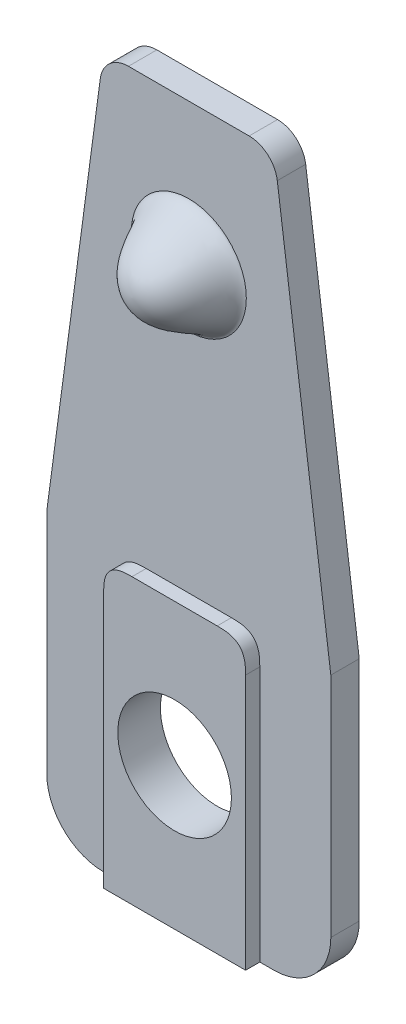
ISO-10303-21;
HEADER;
FILE_DESCRIPTION(('STEP AP214'),'2;1');
FILE_NAME('part.step','',(''),(''),'','','');
FILE_SCHEMA(('AUTOMOTIVE_DESIGN { 1 0 10303 214 1 1 1 1 }'));
ENDSEC;
DATA;
#1=APPLICATION_CONTEXT('core data for automotive mechanical design processes');
#2=APPLICATION_PROTOCOL_DEFINITION('international standard','automotive_design',2000,#1);
#3=PRODUCT_CONTEXT('',#1,'mechanical');
#4=PRODUCT('Part','Part','',(#3));
#5=PRODUCT_RELATED_PRODUCT_CATEGORY('part','',(#4));
#6=PRODUCT_DEFINITION_FORMATION('','',#4);
#7=PRODUCT_DEFINITION_CONTEXT('part definition',#1,'design');
#8=PRODUCT_DEFINITION('design','',#6,#7);
#9=PRODUCT_DEFINITION_SHAPE('','',#8);
#10=(LENGTH_UNIT() NAMED_UNIT(*) SI_UNIT(.MILLI.,.METRE.));
#11=(NAMED_UNIT(*) PLANE_ANGLE_UNIT() SI_UNIT($,.RADIAN.));
#12=(NAMED_UNIT(*) SI_UNIT($,.STERADIAN.) SOLID_ANGLE_UNIT());
#13=UNCERTAINTY_MEASURE_WITH_UNIT(LENGTH_MEASURE(1.E-05),#10,'distance_accuracy_value','');
#14=(GEOMETRIC_REPRESENTATION_CONTEXT(3) GLOBAL_UNCERTAINTY_ASSIGNED_CONTEXT((#13)) GLOBAL_UNIT_ASSIGNED_CONTEXT((#10,
#11,#12)) REPRESENTATION_CONTEXT('',''));
#15=CARTESIAN_POINT('',(0.,0.,0.));
#16=DIRECTION('',(0.,0.,1.));
#17=DIRECTION('',(1.,0.,0.));
#18=AXIS2_PLACEMENT_3D('',#15,#16,#17);
#19=CARTESIAN_POINT('',(3.,-4.86029411764706,1.));
#20=DIRECTION('',(0.,0.,-1.));
#21=DIRECTION('',(-1.,0.,0.));
#22=AXIS2_PLACEMENT_3D('',#19,#20,#21);
#23=CYLINDRICAL_SURFACE('',#22,2.);
#24=CARTESIAN_POINT('',(3.,-4.86029411764706,0.));
#25=DIRECTION('',(0.,0.,1.));
#26=DIRECTION('',(1.,0.,0.));
#27=AXIS2_PLACEMENT_3D('',#24,#25,#26);
#28=CIRCLE('',#27,2.);
#29=CARTESIAN_POINT('',(2.99999999999999,-6.86029411764706,0.));
#30=VERTEX_POINT('',#29);
#31=CARTESIAN_POINT('',(5.,-4.86029411764705,0.));
#32=VERTEX_POINT('',#31);
#33=EDGE_CURVE('E498',#30,#32,#28,.T.);
#34=ORIENTED_EDGE('',*,*,#33,.T.);
#35=DIRECTION('',(0.,0.,-1.));
#36=VECTOR('',#35,1.);
#37=CARTESIAN_POINT('',(5.,-4.86029411764705,1.));
#38=LINE('',#37,#36);
#39=CARTESIAN_POINT('',(5.,-4.86029411764705,1.));
#40=VERTEX_POINT('',#39);
#41=EDGE_CURVE('E263',#40,#32,#38,.T.);
#42=ORIENTED_EDGE('',*,*,#41,.F.);
#43=CARTESIAN_POINT('',(3.,-4.86029411764706,1.));
#44=DIRECTION('',(0.,0.,1.));
#45=DIRECTION('',(1.,0.,0.));
#46=AXIS2_PLACEMENT_3D('',#43,#44,#45);
#47=CIRCLE('',#46,2.);
#48=CARTESIAN_POINT('',(2.99999999999999,-6.86029411764706,1.));
#49=VERTEX_POINT('',#48);
#50=EDGE_CURVE('E458',#49,#40,#47,.T.);
#51=ORIENTED_EDGE('',*,*,#50,.F.);
#52=DIRECTION('',(0.,0.,-1.));
#53=VECTOR('',#52,1.);
#54=CARTESIAN_POINT('',(2.99999999999999,-6.86029411764706,1.));
#55=LINE('',#54,#53);
#56=EDGE_CURVE('E459',#49,#30,#55,.T.);
#57=ORIENTED_EDGE('',*,*,#56,.T.);
#58=EDGE_LOOP('',(#34,#42,#51,#57));
#59=FACE_BOUND('',#58,.T.);
#60=ADVANCED_FACE('F35',(#59),#23,.T.);
#61=CARTESIAN_POINT('',(5.,-4.86029411764705,1.));
#62=DIRECTION('',(-1.,0.,0.));
#63=DIRECTION('',(0.,0.,1.));
#64=AXIS2_PLACEMENT_3D('',#61,#62,#63);
#65=PLANE('',#64);
#66=DIRECTION('',(0.,1.,0.));
#67=VECTOR('',#66,1.);
#68=CARTESIAN_POINT('',(5.,-4.86029411764705,0.));
#69=LINE('',#68,#67);
#70=CARTESIAN_POINT('',(5.,3.13970588235294,0.));
#71=VERTEX_POINT('',#70);
#72=EDGE_CURVE('E433',#32,#71,#69,.T.);
#73=ORIENTED_EDGE('',*,*,#72,.T.);
#74=DIRECTION('',(0.,0.,-1.));
#75=VECTOR('',#74,1.);
#76=CARTESIAN_POINT('',(5.,3.13970588235294,1.));
#77=LINE('',#76,#75);
#78=CARTESIAN_POINT('',(5.,3.13970588235294,1.));
#79=VERTEX_POINT('',#78);
#80=EDGE_CURVE('E267',#79,#71,#77,.T.);
#81=ORIENTED_EDGE('',*,*,#80,.F.);
#82=DIRECTION('',(0.,1.,0.));
#83=VECTOR('',#82,1.);
#84=CARTESIAN_POINT('',(5.,-4.86029411764705,1.));
#85=LINE('',#84,#83);
#86=EDGE_CURVE('E525',#40,#79,#85,.T.);
#87=ORIENTED_EDGE('',*,*,#86,.F.);
#88=ORIENTED_EDGE('',*,*,#41,.T.);
#89=EDGE_LOOP('',(#73,#81,#87,#88));
#90=FACE_BOUND('',#89,.T.);
#91=ADVANCED_FACE('F174',(#90),#65,.F.);
#92=CARTESIAN_POINT('',(5.,3.13970588235294,1.));
#93=DIRECTION('',(-0.991227900682635,-0.132163720091018,0.));
#94=DIRECTION('',(0.132163720091018,-0.991227900682635,0.));
#95=AXIS2_PLACEMENT_3D('',#92,#93,#94);
#96=PLANE('',#95);
#97=DIRECTION('',(-0.132163720091018,0.991227900682635,0.));
#98=VECTOR('',#97,1.);
#99=CARTESIAN_POINT('',(5.,3.13970588235294,0.));
#100=LINE('',#99,#98);
#101=CARTESIAN_POINT('',(3.11571150398787,17.2718696024439,0.));
#102=VERTEX_POINT('',#101);
#103=EDGE_CURVE('E424',#71,#102,#100,.T.);
#104=ORIENTED_EDGE('',*,*,#103,.T.);
#105=DIRECTION('',(0.,0.,-1.));
#106=VECTOR('',#105,1.);
#107=CARTESIAN_POINT('',(3.11571150398787,17.2718696024439,1.));
#108=LINE('',#107,#106);
#109=CARTESIAN_POINT('',(3.11571150398787,17.2718696024439,1.));
#110=VERTEX_POINT('',#109);
#111=EDGE_CURVE('E427',#110,#102,#108,.T.);
#112=ORIENTED_EDGE('',*,*,#111,.F.);
#113=DIRECTION('',(-0.132163720091018,0.991227900682635,0.));
#114=VECTOR('',#113,1.);
#115=CARTESIAN_POINT('',(5.,3.13970588235294,1.));
#116=LINE('',#115,#114);
#117=EDGE_CURVE('E486',#79,#110,#116,.T.);
#118=ORIENTED_EDGE('',*,*,#117,.F.);
#119=ORIENTED_EDGE('',*,*,#80,.T.);
#120=EDGE_LOOP('',(#104,#112,#118,#119));
#121=FACE_BOUND('',#120,.T.);
#122=ADVANCED_FACE('F180',(#121),#96,.F.);
#123=CARTESIAN_POINT('',(2.12448360330523,17.1397058823529,1.));
#124=DIRECTION('',(0.,0.,-1.));
#125=DIRECTION('',(-1.,0.,0.));
#126=AXIS2_PLACEMENT_3D('',#123,#124,#125);
#127=CYLINDRICAL_SURFACE('',#126,1.);
#128=CARTESIAN_POINT('',(2.12448360330523,17.1397058823529,0.));
#129=DIRECTION('',(0.,0.,1.));
#130=DIRECTION('',(1.,0.,0.));
#131=AXIS2_PLACEMENT_3D('',#128,#129,#130);
#132=CIRCLE('',#131,1.);
#133=CARTESIAN_POINT('',(2.12448360330522,18.1397058823529,0.));
#134=VERTEX_POINT('',#133);
#135=EDGE_CURVE('E432',#102,#134,#132,.T.);
#136=ORIENTED_EDGE('',*,*,#135,.T.);
#137=DIRECTION('',(0.,0.,-1.));
#138=VECTOR('',#137,1.);
#139=CARTESIAN_POINT('',(2.12448360330522,18.1397058823529,1.));
#140=LINE('',#139,#138);
#141=CARTESIAN_POINT('',(2.12448360330522,18.1397058823529,1.));
#142=VERTEX_POINT('',#141);
#143=EDGE_CURVE('E438',#142,#134,#140,.T.);
#144=ORIENTED_EDGE('',*,*,#143,.F.);
#145=CARTESIAN_POINT('',(2.12448360330523,17.1397058823529,1.));
#146=DIRECTION('',(0.,0.,1.));
#147=DIRECTION('',(1.,0.,0.));
#148=AXIS2_PLACEMENT_3D('',#145,#146,#147);
#149=CIRCLE('',#148,1.);
#150=EDGE_CURVE('E437',#110,#142,#149,.T.);
#151=ORIENTED_EDGE('',*,*,#150,.F.);
#152=ORIENTED_EDGE('',*,*,#111,.T.);
#153=EDGE_LOOP('',(#136,#144,#151,#152));
#154=FACE_BOUND('',#153,.T.);
#155=ADVANCED_FACE('F413',(#154),#127,.T.);
#156=CARTESIAN_POINT('',(2.12448360330522,18.1397058823529,1.));
#157=DIRECTION('',(0.,-1.,0.));
#158=DIRECTION('',(0.,0.,-1.));
#159=AXIS2_PLACEMENT_3D('',#156,#157,#158);
#160=PLANE('',#159);
#161=DIRECTION('',(-1.,0.,0.));
#162=VECTOR('',#161,1.);
#163=CARTESIAN_POINT('',(2.12448360330522,18.1397058823529,0.));
#164=LINE('',#163,#162);
#165=CARTESIAN_POINT('',(-2.12448360330522,18.1397058823529,0.));
#166=VERTEX_POINT('',#165);
#167=EDGE_CURVE('E443',#134,#166,#164,.T.);
#168=ORIENTED_EDGE('',*,*,#167,.T.);
#169=DIRECTION('',(0.,0.,-1.));
#170=VECTOR('',#169,1.);
#171=CARTESIAN_POINT('',(-2.12448360330522,18.1397058823529,1.));
#172=LINE('',#171,#170);
#173=CARTESIAN_POINT('',(-2.12448360330522,18.1397058823529,1.));
#174=VERTEX_POINT('',#173);
#175=EDGE_CURVE('E475',#174,#166,#172,.T.);
#176=ORIENTED_EDGE('',*,*,#175,.F.);
#177=DIRECTION('',(-1.,0.,0.));
#178=VECTOR('',#177,1.);
#179=CARTESIAN_POINT('',(2.12448360330522,18.1397058823529,1.));
#180=LINE('',#179,#178);
#181=EDGE_CURVE('E480',#142,#174,#180,.T.);
#182=ORIENTED_EDGE('',*,*,#181,.F.);
#183=ORIENTED_EDGE('',*,*,#143,.T.);
#184=EDGE_LOOP('',(#168,#176,#182,#183));
#185=FACE_BOUND('',#184,.T.);
#186=ADVANCED_FACE('F409',(#185),#160,.F.);
#187=CARTESIAN_POINT('',(-2.12448360330523,17.1397058823529,1.));
#188=DIRECTION('',(0.,0.,-1.));
#189=DIRECTION('',(-1.,0.,0.));
#190=AXIS2_PLACEMENT_3D('',#187,#188,#189);
#191=CYLINDRICAL_SURFACE('',#190,1.);
#192=CARTESIAN_POINT('',(-2.12448360330523,17.1397058823529,0.));
#193=DIRECTION('',(0.,0.,1.));
#194=DIRECTION('',(-1.,0.,0.));
#195=AXIS2_PLACEMENT_3D('',#192,#193,#194);
#196=CIRCLE('',#195,1.);
#197=CARTESIAN_POINT('',(-3.11571150398786,17.2718696024439,0.));
#198=VERTEX_POINT('',#197);
#199=EDGE_CURVE('E445',#166,#198,#196,.T.);
#200=ORIENTED_EDGE('',*,*,#199,.T.);
#201=DIRECTION('',(0.,0.,-1.));
#202=VECTOR('',#201,1.);
#203=CARTESIAN_POINT('',(-3.11571150398786,17.2718696024439,1.));
#204=LINE('',#203,#202);
#205=CARTESIAN_POINT('',(-3.11571150398786,17.2718696024439,1.));
#206=VERTEX_POINT('',#205);
#207=EDGE_CURVE('E472',#206,#198,#204,.T.);
#208=ORIENTED_EDGE('',*,*,#207,.F.);
#209=CARTESIAN_POINT('',(-2.12448360330523,17.1397058823529,1.));
#210=DIRECTION('',(0.,0.,1.));
#211=DIRECTION('',(-1.,0.,0.));
#212=AXIS2_PLACEMENT_3D('',#209,#210,#211);
#213=CIRCLE('',#212,1.);
#214=EDGE_CURVE('E482',#174,#206,#213,.T.);
#215=ORIENTED_EDGE('',*,*,#214,.F.);
#216=ORIENTED_EDGE('',*,*,#175,.T.);
#217=EDGE_LOOP('',(#200,#208,#215,#216));
#218=FACE_BOUND('',#217,.T.);
#219=ADVANCED_FACE('F405',(#218),#191,.T.);
#220=CARTESIAN_POINT('',(-5.,3.13970588235294,1.));
#221=DIRECTION('',(0.991227900682635,-0.132163720091018,0.));
#222=DIRECTION('',(0.132163720091018,0.991227900682635,0.));
#223=AXIS2_PLACEMENT_3D('',#220,#221,#222);
#224=PLANE('',#223);
#225=DIRECTION('',(-0.132163720091018,-0.991227900682635,0.));
#226=VECTOR('',#225,1.);
#227=CARTESIAN_POINT('',(-5.,3.13970588235294,0.));
#228=LINE('',#227,#226);
#229=CARTESIAN_POINT('',(-5.,3.13970588235294,0.));
#230=VERTEX_POINT('',#229);
#231=EDGE_CURVE('E450',#198,#230,#228,.T.);
#232=ORIENTED_EDGE('',*,*,#231,.T.);
#233=DIRECTION('',(0.,0.,-1.));
#234=VECTOR('',#233,1.);
#235=CARTESIAN_POINT('',(-5.,3.13970588235294,1.));
#236=LINE('',#235,#234);
#237=CARTESIAN_POINT('',(-5.,3.13970588235294,1.));
#238=VERTEX_POINT('',#237);
#239=EDGE_CURVE('E469',#238,#230,#236,.T.);
#240=ORIENTED_EDGE('',*,*,#239,.F.);
#241=DIRECTION('',(-0.132163720091018,-0.991227900682635,0.));
#242=VECTOR('',#241,1.);
#243=CARTESIAN_POINT('',(-5.,3.13970588235294,1.));
#244=LINE('',#243,#242);
#245=EDGE_CURVE('E484',#206,#238,#244,.T.);
#246=ORIENTED_EDGE('',*,*,#245,.F.);
#247=ORIENTED_EDGE('',*,*,#207,.T.);
#248=EDGE_LOOP('',(#232,#240,#246,#247));
#249=FACE_BOUND('',#248,.T.);
#250=ADVANCED_FACE('F401',(#249),#224,.F.);
#251=CARTESIAN_POINT('',(-5.,-4.86029411764706,1.));
#252=DIRECTION('',(1.,0.,0.));
#253=DIRECTION('',(0.,0.,-1.));
#254=AXIS2_PLACEMENT_3D('',#251,#252,#253);
#255=PLANE('',#254);
#256=DIRECTION('',(0.,-1.,0.));
#257=VECTOR('',#256,1.);
#258=CARTESIAN_POINT('',(-5.,-4.86029411764706,0.));
#259=LINE('',#258,#257);
#260=CARTESIAN_POINT('',(-5.,-4.86029411764706,0.));
#261=VERTEX_POINT('',#260);
#262=EDGE_CURVE('E452',#230,#261,#259,.T.);
#263=ORIENTED_EDGE('',*,*,#262,.T.);
#264=DIRECTION('',(0.,0.,-1.));
#265=VECTOR('',#264,1.);
#266=CARTESIAN_POINT('',(-5.,-4.86029411764706,1.));
#267=LINE('',#266,#265);
#268=CARTESIAN_POINT('',(-5.,-4.86029411764706,1.));
#269=VERTEX_POINT('',#268);
#270=EDGE_CURVE('E466',#269,#261,#267,.T.);
#271=ORIENTED_EDGE('',*,*,#270,.F.);
#272=DIRECTION('',(0.,-1.,0.));
#273=VECTOR('',#272,1.);
#274=CARTESIAN_POINT('',(-5.,-4.86029411764706,1.));
#275=LINE('',#274,#273);
#276=EDGE_CURVE('E491',#238,#269,#275,.T.);
#277=ORIENTED_EDGE('',*,*,#276,.F.);
#278=ORIENTED_EDGE('',*,*,#239,.T.);
#279=EDGE_LOOP('',(#263,#271,#277,#278));
#280=FACE_BOUND('',#279,.T.);
#281=ADVANCED_FACE('F397',(#280),#255,.F.);
#282=CARTESIAN_POINT('',(-3.,-4.86029411764706,1.));
#283=DIRECTION('',(0.,0.,-1.));
#284=DIRECTION('',(-1.,0.,0.));
#285=AXIS2_PLACEMENT_3D('',#282,#283,#284);
#286=CYLINDRICAL_SURFACE('',#285,2.);
#287=CARTESIAN_POINT('',(-3.,-4.86029411764706,0.));
#288=DIRECTION('',(0.,0.,1.));
#289=DIRECTION('',(1.,0.,0.));
#290=AXIS2_PLACEMENT_3D('',#287,#288,#289);
#291=CIRCLE('',#290,2.);
#292=CARTESIAN_POINT('',(-3.,-6.86029411764706,0.));
#293=VERTEX_POINT('',#292);
#294=EDGE_CURVE('E454',#261,#293,#291,.T.);
#295=ORIENTED_EDGE('',*,*,#294,.T.);
#296=DIRECTION('',(0.,0.,-1.));
#297=VECTOR('',#296,1.);
#298=CARTESIAN_POINT('',(-3.,-6.86029411764706,1.));
#299=LINE('',#298,#297);
#300=CARTESIAN_POINT('',(-3.,-6.86029411764706,1.));
#301=VERTEX_POINT('',#300);
#302=EDGE_CURVE('E462',#301,#293,#299,.T.);
#303=ORIENTED_EDGE('',*,*,#302,.F.);
#304=CARTESIAN_POINT('',(-3.,-4.86029411764706,1.));
#305=DIRECTION('',(0.,0.,1.));
#306=DIRECTION('',(1.,0.,0.));
#307=AXIS2_PLACEMENT_3D('',#304,#305,#306);
#308=CIRCLE('',#307,2.);
#309=EDGE_CURVE('E493',#269,#301,#308,.T.);
#310=ORIENTED_EDGE('',*,*,#309,.F.);
#311=ORIENTED_EDGE('',*,*,#270,.T.);
#312=EDGE_LOOP('',(#295,#303,#310,#311));
#313=FACE_BOUND('',#312,.T.);
#314=ADVANCED_FACE('F393',(#313),#286,.T.);
#315=CARTESIAN_POINT('',(-3.,-6.86029411764706,1.));
#316=DIRECTION('',(0.,1.,0.));
#317=DIRECTION('',(-1.,0.,0.));
#318=AXIS2_PLACEMENT_3D('',#315,#316,#317);
#319=PLANE('',#318);
#320=DIRECTION('',(1.,0.,0.));
#321=VECTOR('',#320,1.);
#322=CARTESIAN_POINT('',(-3.,-6.86029411764706,0.));
#323=LINE('',#322,#321);
#324=EDGE_CURVE('E456',#293,#30,#323,.T.);
#325=ORIENTED_EDGE('',*,*,#324,.T.);
#326=ORIENTED_EDGE('',*,*,#56,.F.);
#327=DIRECTION('',(1.,0.,0.));
#328=VECTOR('',#327,1.);
#329=CARTESIAN_POINT('',(-3.,-6.86029411764706,1.));
#330=LINE('',#329,#328);
#331=CARTESIAN_POINT('',(2.5,-6.86029411764706,1.));
#332=VERTEX_POINT('',#331);
#333=EDGE_CURVE('E495',#332,#49,#330,.T.);
#334=ORIENTED_EDGE('',*,*,#333,.F.);
#335=DIRECTION('',(0.,0.,-1.));
#336=VECTOR('',#335,1.);
#337=CARTESIAN_POINT('',(2.5,-6.86029411764706,1.5));
#338=LINE('',#337,#336);
#339=CARTESIAN_POINT('',(2.5,-6.86029411764706,1.5));
#340=VERTEX_POINT('',#339);
#341=EDGE_CURVE('E499',#340,#332,#338,.T.);
#342=ORIENTED_EDGE('',*,*,#341,.F.);
#343=DIRECTION('',(1.,0.,0.));
#344=VECTOR('',#343,1.);
#345=CARTESIAN_POINT('',(2.5,-6.86029411764706,1.5));
#346=LINE('',#345,#344);
#347=CARTESIAN_POINT('',(-2.50000000000002,-6.86029411764706,1.5));
#348=VERTEX_POINT('',#347);
#349=EDGE_CURVE('E290',#348,#340,#346,.T.);
#350=ORIENTED_EDGE('',*,*,#349,.F.);
#351=DIRECTION('',(0.,0.,-1.));
#352=VECTOR('',#351,1.);
#353=CARTESIAN_POINT('',(-2.50000000000002,-6.86029411764706,1.5));
#354=LINE('',#353,#352);
#355=CARTESIAN_POINT('',(-2.50000000000001,-6.86029411764706,1.));
#356=VERTEX_POINT('',#355);
#357=EDGE_CURVE('E285',#348,#356,#354,.T.);
#358=ORIENTED_EDGE('',*,*,#357,.T.);
#359=EDGE_CURVE('E463',#301,#356,#330,.T.);
#360=ORIENTED_EDGE('',*,*,#359,.F.);
#361=ORIENTED_EDGE('',*,*,#302,.T.);
#362=EDGE_LOOP('',(#325,#326,#334,#342,#350,#358,#360,#361));
#363=FACE_BOUND('',#362,.T.);
#364=ADVANCED_FACE('F378',(#363),#319,.F.);
#365=CARTESIAN_POINT('',(3.,-4.86029411764706,1.));
#366=DIRECTION('',(0.,0.,1.));
#367=DIRECTION('',(1.,0.,0.));
#368=AXIS2_PLACEMENT_3D('',#365,#366,#367);
#369=PLANE('',#368);
#370=CARTESIAN_POINT('',(0.,13.1397058823529,1.));
#371=DIRECTION('',(0.,0.,1.));
#372=DIRECTION('',(1.,0.,0.));
#373=AXIS2_PLACEMENT_3D('',#370,#371,#372);
#374=CIRCLE('',#373,2.02512671208352);
#375=CARTESIAN_POINT('',(2.02512671208352,13.1397058823529,0.999999999999998));
#376=VERTEX_POINT('',#375);
#377=EDGE_CURVE('E261',#376,#376,#374,.T.);
#378=ORIENTED_EDGE('',*,*,#377,.F.);
#379=EDGE_LOOP('',(#378));
#380=FACE_BOUND('',#379,.T.);
#381=DIRECTION('',(0.,-1.,0.));
#382=VECTOR('',#381,1.);
#383=CARTESIAN_POINT('',(-2.50000000000002,-6.86029411764706,1.));
#384=LINE('',#383,#382);
#385=CARTESIAN_POINT('',(-2.5,2.13970588235294,1.));
#386=VERTEX_POINT('',#385);
#387=EDGE_CURVE('E274',#386,#356,#384,.T.);
#388=ORIENTED_EDGE('',*,*,#387,.F.);
#389=CARTESIAN_POINT('',(-1.5,3.13970588235294,1.));
#390=CARTESIAN_POINT('',(-1.66819805153395,3.13970588235294,1.));
#391=CARTESIAN_POINT('',(-1.83639610306789,3.13970588235294,1.));
#392=CARTESIAN_POINT('',(-2.20710678118655,3.06801396251686,1.));
#393=CARTESIAN_POINT('',(-2.42830808016392,2.84681266353949,1.));
#394=CARTESIAN_POINT('',(-2.5,2.47610198542084,1.));
#395=CARTESIAN_POINT('',(-2.5,2.30790393388689,1.));
#396=CARTESIAN_POINT('',(-2.5,2.13970588235294,1.));
#397=B_SPLINE_CURVE_WITH_KNOTS('',5,(#389,#390,#391,#392,#393,#394,#395,#396),.UNSPECIFIED.,.F.,
.F.,(6,2,6),(0.,0.5,1.),.UNSPECIFIED.);
#398=CARTESIAN_POINT('',(-1.5,3.13970588235294,1.));
#399=VERTEX_POINT('',#398);
#400=EDGE_CURVE('E11',#386,#399,#397,.F.);
#401=ORIENTED_EDGE('',*,*,#400,.T.);
#402=DIRECTION('',(-1.,0.,0.));
#403=VECTOR('',#402,1.);
#404=CARTESIAN_POINT('',(2.5,3.13970588235294,1.));
#405=LINE('',#404,#403);
#406=CARTESIAN_POINT('',(1.5,3.13970588235294,1.));
#407=VERTEX_POINT('',#406);
#408=EDGE_CURVE('E271',#407,#399,#405,.T.);
#409=ORIENTED_EDGE('',*,*,#408,.F.);
#410=CARTESIAN_POINT('',(2.5,2.13970588235294,1.));
#411=CARTESIAN_POINT('',(2.5,2.30790393388689,1.));
#412=CARTESIAN_POINT('',(2.5,2.47610198542083,1.));
#413=CARTESIAN_POINT('',(2.42830808016392,2.84681266353949,1.));
#414=CARTESIAN_POINT('',(2.20710678118655,3.06801396251686,1.));
#415=CARTESIAN_POINT('',(1.83639610306789,3.13970588235294,1.));
#416=CARTESIAN_POINT('',(1.66819805153395,3.13970588235294,1.));
#417=CARTESIAN_POINT('',(1.5,3.13970588235294,1.));
#418=B_SPLINE_CURVE_WITH_KNOTS('',5,(#410,#411,#412,#413,#414,#415,#416,#417),.UNSPECIFIED.,.F.,
.F.,(6,2,6),(0.,0.5,1.),.UNSPECIFIED.);
#419=CARTESIAN_POINT('',(2.5,2.13970588235294,1.));
#420=VERTEX_POINT('',#419);
#421=EDGE_CURVE('E49',#407,#420,#418,.F.);
#422=ORIENTED_EDGE('',*,*,#421,.T.);
#423=DIRECTION('',(0.,1.,0.));
#424=VECTOR('',#423,1.);
#425=CARTESIAN_POINT('',(2.5,-6.86029411764706,1.));
#426=LINE('',#425,#424);
#427=EDGE_CURVE('E275',#332,#420,#426,.T.);
#428=ORIENTED_EDGE('',*,*,#427,.F.);
#429=ORIENTED_EDGE('',*,*,#333,.T.);
#430=ORIENTED_EDGE('',*,*,#50,.T.);
#431=ORIENTED_EDGE('',*,*,#86,.T.);
#432=ORIENTED_EDGE('',*,*,#117,.T.);
#433=ORIENTED_EDGE('',*,*,#150,.T.);
#434=ORIENTED_EDGE('',*,*,#181,.T.);
#435=ORIENTED_EDGE('',*,*,#214,.T.);
#436=ORIENTED_EDGE('',*,*,#245,.T.);
#437=ORIENTED_EDGE('',*,*,#276,.T.);
#438=ORIENTED_EDGE('',*,*,#309,.T.);
#439=ORIENTED_EDGE('',*,*,#359,.T.);
#440=EDGE_LOOP('',(#388,#401,#409,#422,#428,#429,#430,#431,#432,#433,#434,#435,#436,#437,#438,#439));
#441=FACE_BOUND('',#440,.T.);
#442=ADVANCED_FACE('F368',(#380,#441),#369,.T.);
#443=CARTESIAN_POINT('',(3.,-4.86029411764706,0.));
#444=DIRECTION('',(0.,0.,1.));
#445=DIRECTION('',(1.,0.,0.));
#446=AXIS2_PLACEMENT_3D('',#443,#444,#445);
#447=PLANE('',#446);
#448=CARTESIAN_POINT('',(0.,-1.86029411764706,0.));
#449=DIRECTION('',(0.,0.,1.));
#450=DIRECTION('',(1.,0.,0.));
#451=AXIS2_PLACEMENT_3D('',#448,#449,#450);
#452=CIRCLE('',#451,2.);
#453=CARTESIAN_POINT('',(2.,-1.86029411764706,0.));
#454=VERTEX_POINT('',#453);
#455=EDGE_CURVE('E336',#454,#454,#452,.T.);
#456=ORIENTED_EDGE('',*,*,#455,.T.);
#457=EDGE_LOOP('',(#456));
#458=FACE_BOUND('',#457,.T.);
#459=ORIENTED_EDGE('',*,*,#33,.F.);
#460=ORIENTED_EDGE('',*,*,#324,.F.);
#461=ORIENTED_EDGE('',*,*,#294,.F.);
#462=ORIENTED_EDGE('',*,*,#262,.F.);
#463=ORIENTED_EDGE('',*,*,#231,.F.);
#464=ORIENTED_EDGE('',*,*,#199,.F.);
#465=ORIENTED_EDGE('',*,*,#167,.F.);
#466=ORIENTED_EDGE('',*,*,#135,.F.);
#467=ORIENTED_EDGE('',*,*,#103,.F.);
#468=ORIENTED_EDGE('',*,*,#72,.F.);
#469=EDGE_LOOP('',(#459,#460,#461,#462,#463,#464,#465,#466,#467,#468));
#470=FACE_BOUND('',#469,.T.);
#471=ADVANCED_FACE('F377',(#458,#470),#447,.F.);
#472=CARTESIAN_POINT('',(2.5,-6.86029411764706,1.5));
#473=DIRECTION('',(-1.,0.,0.));
#474=DIRECTION('',(0.,0.,1.));
#475=AXIS2_PLACEMENT_3D('',#472,#473,#474);
#476=PLANE('',#475);
#477=ORIENTED_EDGE('',*,*,#427,.T.);
#478=CARTESIAN_POINT('',(2.5,2.13970588235294,1.525));
#479=CARTESIAN_POINT('',(2.5,2.13970588235294,1.34166666666662));
#480=CARTESIAN_POINT('',(2.5,2.13970588235294,1.15833333333333));
#481=CARTESIAN_POINT('',(2.5,2.13970588235294,0.975));
#482=B_SPLINE_CURVE_WITH_KNOTS('',3,(#478,#479,#480,#481),.UNSPECIFIED.,.F.,.F.,(4,4),(-2.5E-05,
0.000525),.UNSPECIFIED.);
#483=CARTESIAN_POINT('',(2.5,2.13970588235294,1.5));
#484=VERTEX_POINT('',#483);
#485=EDGE_CURVE('E220',#420,#484,#482,.F.);
#486=ORIENTED_EDGE('',*,*,#485,.T.);
#487=DIRECTION('',(0.,1.,0.));
#488=VECTOR('',#487,1.);
#489=CARTESIAN_POINT('',(2.5,-6.86029411764706,1.5));
#490=LINE('',#489,#488);
#491=EDGE_CURVE('E337',#340,#484,#490,.T.);
#492=ORIENTED_EDGE('',*,*,#491,.F.);
#493=ORIENTED_EDGE('',*,*,#341,.T.);
#494=EDGE_LOOP('',(#477,#486,#492,#493));
#495=FACE_BOUND('',#494,.T.);
#496=ADVANCED_FACE('F317',(#495),#476,.F.);
#497=CARTESIAN_POINT('',(2.5,3.13970588235294,1.5));
#498=DIRECTION('',(0.,-1.,0.));
#499=DIRECTION('',(1.,0.,0.));
#500=AXIS2_PLACEMENT_3D('',#497,#498,#499);
#501=PLANE('',#500);
#502=DIRECTION('',(-1.,0.,0.));
#503=VECTOR('',#502,1.);
#504=CARTESIAN_POINT('',(2.5,3.13970588235294,1.5));
#505=LINE('',#504,#503);
#506=CARTESIAN_POINT('',(1.5,3.13970588235294,1.5));
#507=VERTEX_POINT('',#506);
#508=CARTESIAN_POINT('',(-1.5,3.13970588235294,1.5));
#509=VERTEX_POINT('',#508);
#510=EDGE_CURVE('E276',#507,#509,#505,.T.);
#511=ORIENTED_EDGE('',*,*,#510,.F.);
#512=CARTESIAN_POINT('',(1.5,3.13970588235294,0.975));
#513=CARTESIAN_POINT('',(1.5,3.13970588235294,1.15833333333333));
#514=CARTESIAN_POINT('',(1.5,3.13970588235294,1.34166666666662));
#515=CARTESIAN_POINT('',(1.5,3.13970588235294,1.525));
#516=B_SPLINE_CURVE_WITH_KNOTS('',3,(#512,#513,#514,#515),.UNSPECIFIED.,.F.,.F.,(4,4),(-2.5E-05,
0.000525),.UNSPECIFIED.);
#517=EDGE_CURVE('E260',#507,#407,#516,.F.);
#518=ORIENTED_EDGE('',*,*,#517,.T.);
#519=ORIENTED_EDGE('',*,*,#408,.T.);
#520=CARTESIAN_POINT('',(-1.5,3.13970588235294,1.525));
#521=CARTESIAN_POINT('',(-1.5,3.13970588235294,1.34166666666662));
#522=CARTESIAN_POINT('',(-1.5,3.13970588235294,1.15833333333333));
#523=CARTESIAN_POINT('',(-1.5,3.13970588235294,0.975));
#524=B_SPLINE_CURVE_WITH_KNOTS('',3,(#520,#521,#522,#523),.UNSPECIFIED.,.F.,.F.,(4,4),(-2.5E-05,
0.000525),.UNSPECIFIED.);
#525=EDGE_CURVE('E255',#399,#509,#524,.F.);
#526=ORIENTED_EDGE('',*,*,#525,.T.);
#527=EDGE_LOOP('',(#511,#518,#519,#526));
#528=FACE_BOUND('',#527,.T.);
#529=ADVANCED_FACE('F312',(#528),#501,.F.);
#530=CARTESIAN_POINT('',(-2.50000000000002,-6.86029411764706,1.5));
#531=DIRECTION('',(1.,0.,0.));
#532=DIRECTION('',(0.,1.,0.));
#533=AXIS2_PLACEMENT_3D('',#530,#531,#532);
#534=PLANE('',#533);
#535=DIRECTION('',(0.,-1.,0.));
#536=VECTOR('',#535,1.);
#537=CARTESIAN_POINT('',(-2.50000000000002,-6.86029411764706,1.5));
#538=LINE('',#537,#536);
#539=CARTESIAN_POINT('',(-2.5,2.13970588235294,1.5));
#540=VERTEX_POINT('',#539);
#541=EDGE_CURVE('E348',#540,#348,#538,.T.);
#542=ORIENTED_EDGE('',*,*,#541,.F.);
#543=CARTESIAN_POINT('',(-2.5,2.13970588235294,0.975));
#544=CARTESIAN_POINT('',(-2.5,2.13970588235294,1.15833333333333));
#545=CARTESIAN_POINT('',(-2.5,2.13970588235294,1.34166666666662));
#546=CARTESIAN_POINT('',(-2.5,2.13970588235294,1.525));
#547=B_SPLINE_CURVE_WITH_KNOTS('',3,(#543,#544,#545,#546),.UNSPECIFIED.,.F.,.F.,(4,4),(-2.5E-05,
0.000525),.UNSPECIFIED.);
#548=EDGE_CURVE('E238',#540,#386,#547,.F.);
#549=ORIENTED_EDGE('',*,*,#548,.T.);
#550=ORIENTED_EDGE('',*,*,#387,.T.);
#551=ORIENTED_EDGE('',*,*,#357,.F.);
#552=EDGE_LOOP('',(#542,#549,#550,#551));
#553=FACE_BOUND('',#552,.T.);
#554=ADVANCED_FACE('F303',(#553),#534,.F.);
#555=CARTESIAN_POINT('',(0.,0.,1.5));
#556=DIRECTION('',(0.,0.,-1.));
#557=DIRECTION('',(-1.,0.,0.));
#558=AXIS2_PLACEMENT_3D('',#555,#556,#557);
#559=PLANE('',#558);
#560=CARTESIAN_POINT('',(0.,-1.86029411764706,1.5));
#561=DIRECTION('',(0.,0.,1.));
#562=DIRECTION('',(1.,0.,0.));
#563=AXIS2_PLACEMENT_3D('',#560,#561,#562);
#564=CIRCLE('',#563,2.);
#565=CARTESIAN_POINT('',(2.,-1.86029411764706,1.5));
#566=VERTEX_POINT('',#565);
#567=EDGE_CURVE('E649',#566,#566,#564,.T.);
#568=ORIENTED_EDGE('',*,*,#567,.F.);
#569=EDGE_LOOP('',(#568));
#570=FACE_BOUND('',#569,.T.);
#571=ORIENTED_EDGE('',*,*,#491,.T.);
#572=CARTESIAN_POINT('',(1.5,3.13970588235294,1.5));
#573=CARTESIAN_POINT('',(1.66819805153395,3.13970588235294,1.5));
#574=CARTESIAN_POINT('',(1.83639610306789,3.13970588235294,1.5));
#575=CARTESIAN_POINT('',(2.20710678118655,3.06801396251686,1.5));
#576=CARTESIAN_POINT('',(2.42830808016392,2.84681266353949,1.5));
#577=CARTESIAN_POINT('',(2.5,2.47610198542083,1.5));
#578=CARTESIAN_POINT('',(2.5,2.30790393388689,1.5));
#579=CARTESIAN_POINT('',(2.5,2.13970588235294,1.5));
#580=B_SPLINE_CURVE_WITH_KNOTS('',5,(#572,#573,#574,#575,#576,#577,#578,#579),.UNSPECIFIED.,.F.,
.F.,(6,2,6),(0.,0.5,1.),.UNSPECIFIED.);
#581=EDGE_CURVE('E359',#484,#507,#580,.F.);
#582=ORIENTED_EDGE('',*,*,#581,.T.);
#583=ORIENTED_EDGE('',*,*,#510,.T.);
#584=CARTESIAN_POINT('',(-2.5,2.13970588235294,1.5));
#585=CARTESIAN_POINT('',(-2.5,2.30790393388689,1.5));
#586=CARTESIAN_POINT('',(-2.5,2.47610198542084,1.5));
#587=CARTESIAN_POINT('',(-2.42830808016392,2.84681266353949,1.5));
#588=CARTESIAN_POINT('',(-2.20710678118655,3.06801396251686,1.5));
#589=CARTESIAN_POINT('',(-1.8363961030679,3.13970588235294,1.5));
#590=CARTESIAN_POINT('',(-1.66819805153395,3.13970588235294,1.5));
#591=CARTESIAN_POINT('',(-1.5,3.13970588235294,1.5));
#592=B_SPLINE_CURVE_WITH_KNOTS('',5,(#584,#585,#586,#587,#588,#589,#590,#591),.UNSPECIFIED.,.F.,
.F.,(6,2,6),(0.,0.5,1.),.UNSPECIFIED.);
#593=EDGE_CURVE('E63',#509,#540,#592,.F.);
#594=ORIENTED_EDGE('',*,*,#593,.T.);
#595=ORIENTED_EDGE('',*,*,#541,.T.);
#596=ORIENTED_EDGE('',*,*,#349,.T.);
#597=EDGE_LOOP('',(#571,#582,#583,#594,#595,#596));
#598=FACE_BOUND('',#597,.T.);
#599=ADVANCED_FACE('F168',(#570,#598),#559,.F.);
#600=CARTESIAN_POINT('',(0.,-1.86029411764706,0.));
#601=DIRECTION('',(0.,0.,1.));
#602=DIRECTION('',(1.,0.,0.));
#603=AXIS2_PLACEMENT_3D('',#600,#601,#602);
#604=CYLINDRICAL_SURFACE('',#603,2.);
#605=ORIENTED_EDGE('',*,*,#455,.F.);
#606=EDGE_LOOP('',(#605));
#607=FACE_BOUND('',#606,.T.);
#608=ORIENTED_EDGE('',*,*,#567,.T.);
#609=EDGE_LOOP('',(#608));
#610=FACE_BOUND('',#609,.T.);
#611=ADVANCED_FACE('F160',(#607,#610),#604,.F.);
#612=CARTESIAN_POINT('',(0.,13.1397058823529,3.));
#613=CARTESIAN_POINT('',(0.,14.4909646327623,2.95133833974982));
#614=CARTESIAN_POINT('',(0.,14.7766593967849,1.10347250703023));
#615=CARTESIAN_POINT('',(0.,15.1648325944365,1.));
#616=B_SPLINE_CURVE_WITH_KNOTS('',3,(#612,#613,#614,#615),.UNSPECIFIED.,.F.,.F.,(4,4),(0.,1.),.UNSPECIFIED.);
#617=CARTESIAN_POINT('',(0.,13.1397058823529,3.));
#618=DIRECTION('',(0.,0.,1.));
#619=AXIS1_PLACEMENT('',#617,#618);
#620=SURFACE_OF_REVOLUTION('',#616,#619);
#621=ORIENTED_EDGE('',*,*,#377,.T.);
#622=EDGE_LOOP('',(#621));
#623=FACE_BOUND('',#622,.T.);
#624=CARTESIAN_POINT('',(0.,13.1397058823529,3.));
#625=VERTEX_POINT('',#624);
#626=VERTEX_LOOP('',#625);
#627=FACE_BOUND('',#626,.T.);
#628=ADVANCED_FACE('F157',(#623,#627),#620,.F.);
#629=CARTESIAN_POINT('',(1.5,3.13970588235294,1.525));
#630=CARTESIAN_POINT('',(1.5,3.13970588235294,1.34166666666662));
#631=CARTESIAN_POINT('',(1.5,3.13970588235294,1.15833333333333));
#632=CARTESIAN_POINT('',(1.5,3.13970588235294,0.975));
#633=CARTESIAN_POINT('',(1.66819805153395,3.13970588235294,1.525));
#634=CARTESIAN_POINT('',(1.66819805153395,3.13970588235294,1.34166666666662));
#635=CARTESIAN_POINT('',(1.66819805153395,3.13970588235294,1.15833333333333));
#636=CARTESIAN_POINT('',(1.66819805153395,3.13970588235294,0.975));
#637=CARTESIAN_POINT('',(1.83639610306789,3.13970588235294,1.525));
#638=CARTESIAN_POINT('',(1.83639610306789,3.13970588235294,1.34166666666662));
#639=CARTESIAN_POINT('',(1.83639610306789,3.13970588235294,1.15833333333333));
#640=CARTESIAN_POINT('',(1.83639610306789,3.13970588235294,0.975));
#641=CARTESIAN_POINT('',(2.20710678118655,3.06801396251686,1.525));
#642=CARTESIAN_POINT('',(2.20710678118655,3.06801396251686,1.34166666666662));
#643=CARTESIAN_POINT('',(2.20710678118655,3.06801396251686,1.15833333333333));
#644=CARTESIAN_POINT('',(2.20710678118655,3.06801396251686,0.975));
#645=CARTESIAN_POINT('',(2.42830808016392,2.84681266353949,1.525));
#646=CARTESIAN_POINT('',(2.42830808016392,2.84681266353949,1.34166666666662));
#647=CARTESIAN_POINT('',(2.42830808016392,2.84681266353949,1.15833333333333));
#648=CARTESIAN_POINT('',(2.42830808016392,2.84681266353949,0.975));
#649=CARTESIAN_POINT('',(2.5,2.47610198542083,1.525));
#650=CARTESIAN_POINT('',(2.5,2.47610198542083,1.34166666666662));
#651=CARTESIAN_POINT('',(2.5,2.47610198542083,1.15833333333333));
#652=CARTESIAN_POINT('',(2.5,2.47610198542083,0.975));
#653=CARTESIAN_POINT('',(2.5,2.30790393388689,1.525));
#654=CARTESIAN_POINT('',(2.5,2.30790393388689,1.34166666666662));
#655=CARTESIAN_POINT('',(2.5,2.30790393388689,1.15833333333333));
#656=CARTESIAN_POINT('',(2.5,2.30790393388689,0.975));
#657=CARTESIAN_POINT('',(2.5,2.13970588235294,1.525));
#658=CARTESIAN_POINT('',(2.5,2.13970588235294,1.34166666666662));
#659=CARTESIAN_POINT('',(2.5,2.13970588235294,1.15833333333333));
#660=CARTESIAN_POINT('',(2.5,2.13970588235294,0.975));
#661=B_SPLINE_SURFACE_WITH_KNOTS('',5,3,((#629,#630,#631,#632),(#633,#634,#635,#636),(#637,#638,
#639,#640),(#641,#642,#643,#644),(#645,#646,#647,#648),(#649,#650,#651,#652),(#653,#654,#655,
#656),(#657,#658,#659,#660)),.UNSPECIFIED.,.F.,.F.,.F.,(6,2,6),(4,4),(0.,0.5,1.),(-2.5E-05,
0.000525),.UNSPECIFIED.);
#662=ORIENTED_EDGE('',*,*,#581,.F.);
#663=ORIENTED_EDGE('',*,*,#485,.F.);
#664=ORIENTED_EDGE('',*,*,#421,.F.);
#665=ORIENTED_EDGE('',*,*,#517,.F.);
#666=EDGE_LOOP('',(#662,#663,#664,#665));
#667=FACE_BOUND('',#666,.T.);
#668=ADVANCED_FACE('F159',(#667),#661,.T.);
#669=CARTESIAN_POINT('',(-2.5,2.13970588235294,1.525));
#670=CARTESIAN_POINT('',(-2.5,2.13970588235294,1.34166666666662));
#671=CARTESIAN_POINT('',(-2.5,2.13970588235294,1.15833333333333));
#672=CARTESIAN_POINT('',(-2.5,2.13970588235294,0.975));
#673=CARTESIAN_POINT('',(-2.5,2.30790393388689,1.525));
#674=CARTESIAN_POINT('',(-2.5,2.30790393388689,1.34166666666662));
#675=CARTESIAN_POINT('',(-2.5,2.30790393388689,1.15833333333333));
#676=CARTESIAN_POINT('',(-2.5,2.30790393388689,0.975));
#677=CARTESIAN_POINT('',(-2.5,2.47610198542084,1.525));
#678=CARTESIAN_POINT('',(-2.5,2.47610198542084,1.34166666666662));
#679=CARTESIAN_POINT('',(-2.5,2.47610198542084,1.15833333333333));
#680=CARTESIAN_POINT('',(-2.5,2.47610198542084,0.975));
#681=CARTESIAN_POINT('',(-2.42830808016392,2.84681266353949,1.525));
#682=CARTESIAN_POINT('',(-2.42830808016392,2.84681266353949,1.34166666666662));
#683=CARTESIAN_POINT('',(-2.42830808016392,2.84681266353949,1.15833333333333));
#684=CARTESIAN_POINT('',(-2.42830808016392,2.84681266353949,0.975));
#685=CARTESIAN_POINT('',(-2.20710678118655,3.06801396251686,1.525));
#686=CARTESIAN_POINT('',(-2.20710678118655,3.06801396251686,1.34166666666662));
#687=CARTESIAN_POINT('',(-2.20710678118655,3.06801396251686,1.15833333333333));
#688=CARTESIAN_POINT('',(-2.20710678118655,3.06801396251686,0.975));
#689=CARTESIAN_POINT('',(-1.83639610306789,3.13970588235294,1.525));
#690=CARTESIAN_POINT('',(-1.83639610306789,3.13970588235294,1.34166666666662));
#691=CARTESIAN_POINT('',(-1.83639610306789,3.13970588235294,1.15833333333333));
#692=CARTESIAN_POINT('',(-1.83639610306789,3.13970588235294,0.975));
#693=CARTESIAN_POINT('',(-1.66819805153395,3.13970588235294,1.525));
#694=CARTESIAN_POINT('',(-1.66819805153395,3.13970588235294,1.34166666666662));
#695=CARTESIAN_POINT('',(-1.66819805153395,3.13970588235294,1.15833333333333));
#696=CARTESIAN_POINT('',(-1.66819805153395,3.13970588235294,0.975));
#697=CARTESIAN_POINT('',(-1.5,3.13970588235294,1.525));
#698=CARTESIAN_POINT('',(-1.5,3.13970588235294,1.34166666666662));
#699=CARTESIAN_POINT('',(-1.5,3.13970588235294,1.15833333333333));
#700=CARTESIAN_POINT('',(-1.5,3.13970588235294,0.975));
#701=B_SPLINE_SURFACE_WITH_KNOTS('',5,3,((#669,#670,#671,#672),(#673,#674,#675,#676),(#677,#678,
#679,#680),(#681,#682,#683,#684),(#685,#686,#687,#688),(#689,#690,#691,#692),(#693,#694,#695,
#696),(#697,#698,#699,#700)),.UNSPECIFIED.,.F.,.F.,.F.,(6,2,6),(4,4),(0.,0.5,1.),(-2.5E-05,
0.000525),.UNSPECIFIED.);
#702=ORIENTED_EDGE('',*,*,#593,.F.);
#703=ORIENTED_EDGE('',*,*,#525,.F.);
#704=ORIENTED_EDGE('',*,*,#400,.F.);
#705=ORIENTED_EDGE('',*,*,#548,.F.);
#706=EDGE_LOOP('',(#702,#703,#704,#705));
#707=FACE_BOUND('',#706,.T.);
#708=ADVANCED_FACE('F38',(#707),#701,.T.);
#709=CLOSED_SHELL('',(#60,#91,#122,#155,#186,#219,#250,#281,#314,#364,#442,#471,#496,#529,#554,
#599,#611,#628,#668,#708));
#710=MANIFOLD_SOLID_BREP('B2',#709);
#711=ADVANCED_BREP_SHAPE_REPRESENTATION('',(#18,#710),#14);
#712=SHAPE_DEFINITION_REPRESENTATION(#9,#711);
ENDSEC;
END-ISO-10303-21;
